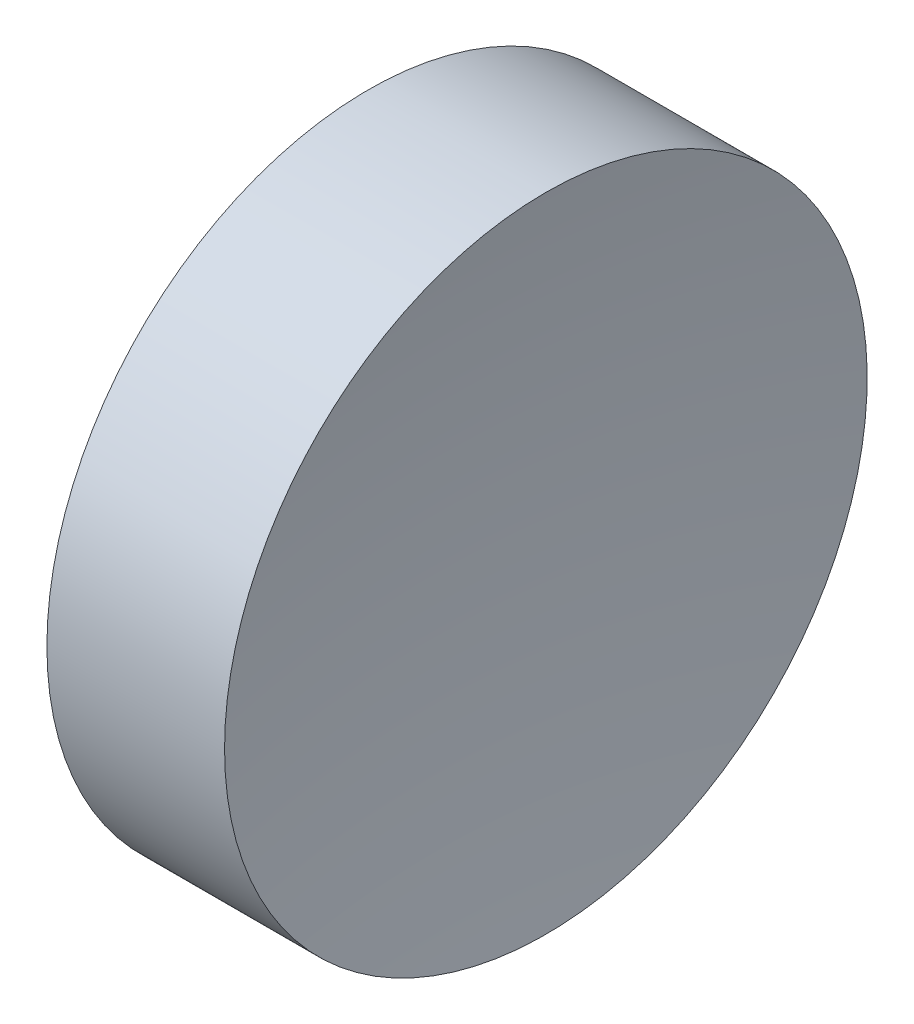
ISO-10303-21;
HEADER;
FILE_DESCRIPTION(('STEP AP214'),'2;1');
FILE_NAME('part.step','',(''),(''),'','','');
FILE_SCHEMA(('AUTOMOTIVE_DESIGN { 1 0 10303 214 1 1 1 1 }'));
ENDSEC;
DATA;
#1=APPLICATION_CONTEXT('core data for automotive mechanical design processes');
#2=APPLICATION_PROTOCOL_DEFINITION('international standard','automotive_design',2000,#1);
#3=PRODUCT_CONTEXT('',#1,'mechanical');
#4=PRODUCT('Part','Part','',(#3));
#5=PRODUCT_RELATED_PRODUCT_CATEGORY('part','',(#4));
#6=PRODUCT_DEFINITION_FORMATION('','',#4);
#7=PRODUCT_DEFINITION_CONTEXT('part definition',#1,'design');
#8=PRODUCT_DEFINITION('design','',#6,#7);
#9=PRODUCT_DEFINITION_SHAPE('','',#8);
#10=(LENGTH_UNIT() NAMED_UNIT(*) SI_UNIT(.MILLI.,.METRE.));
#11=(NAMED_UNIT(*) PLANE_ANGLE_UNIT() SI_UNIT($,.RADIAN.));
#12=(NAMED_UNIT(*) SI_UNIT($,.STERADIAN.) SOLID_ANGLE_UNIT());
#13=UNCERTAINTY_MEASURE_WITH_UNIT(LENGTH_MEASURE(1.E-05),#10,'distance_accuracy_value','');
#14=(GEOMETRIC_REPRESENTATION_CONTEXT(3) GLOBAL_UNCERTAINTY_ASSIGNED_CONTEXT((#13)) GLOBAL_UNIT_ASSIGNED_CONTEXT((#10,
#11,#12)) REPRESENTATION_CONTEXT('',''));
#15=CARTESIAN_POINT('',(0.,0.,0.));
#16=DIRECTION('',(0.,0.,1.));
#17=DIRECTION('',(1.,0.,0.));
#18=AXIS2_PLACEMENT_3D('',#15,#16,#17);
#19=CARTESIAN_POINT('',(44.4592688325745,13.031126091403,0.));
#20=DIRECTION('',(-1.,0.,0.));
#21=DIRECTION('',(0.,1.,0.));
#22=AXIS2_PLACEMENT_3D('',#19,#20,#21);
#23=SPHERICAL_SURFACE('',#22,20.65);
#24=CARTESIAN_POINT('',(24.0509372006159,13.031126091403,0.));
#25=DIRECTION('',(-1.,0.,0.));
#26=DIRECTION('',(0.,0.,1.));
#27=AXIS2_PLACEMENT_3D('',#24,#25,#26);
#28=CIRCLE('',#27,3.15);
#29=CARTESIAN_POINT('',(24.0509372006159,13.031126091403,3.15));
#30=VERTEX_POINT('',#29);
#31=EDGE_CURVE('E10',#30,#30,#28,.T.);
#32=ORIENTED_EDGE('',*,*,#31,.F.);
#33=EDGE_LOOP('',(#32));
#34=FACE_BOUND('',#33,.T.);
#35=ADVANCED_FACE('F35',(#34),#23,.F.);
#36=CARTESIAN_POINT('',(20.6840306351329,13.031126091403,0.));
#37=DIRECTION('',(-1.,0.,0.));
#38=DIRECTION('',(0.,0.,1.));
#39=AXIS2_PLACEMENT_3D('',#36,#37,#38);
#40=CYLINDRICAL_SURFACE('',#39,3.15);
#41=CARTESIAN_POINT('',(22.3092688325745,13.031126091403,0.));
#42=DIRECTION('',(-1.,0.,0.));
#43=DIRECTION('',(0.,0.,1.));
#44=AXIS2_PLACEMENT_3D('',#41,#42,#43);
#45=CIRCLE('',#44,3.15);
#46=CARTESIAN_POINT('',(22.3092688325745,13.031126091403,3.15));
#47=VERTEX_POINT('',#46);
#48=EDGE_CURVE('E41',#47,#47,#45,.T.);
#49=ORIENTED_EDGE('',*,*,#48,.F.);
#50=EDGE_LOOP('',(#49));
#51=FACE_BOUND('',#50,.T.);
#52=ORIENTED_EDGE('',*,*,#31,.T.);
#53=EDGE_LOOP('',(#52));
#54=FACE_BOUND('',#53,.T.);
#55=ADVANCED_FACE('F49',(#51,#54),#40,.T.);
#56=CARTESIAN_POINT('',(22.3092688325745,13.031126091403,0.));
#57=DIRECTION('',(1.,0.,0.));
#58=DIRECTION('',(0.,0.,-1.));
#59=AXIS2_PLACEMENT_3D('',#56,#57,#58);
#60=PLANE('',#59);
#61=ORIENTED_EDGE('',*,*,#48,.T.);
#62=EDGE_LOOP('',(#61));
#63=FACE_BOUND('',#62,.T.);
#64=ADVANCED_FACE('F47',(#63),#60,.F.);
#65=CLOSED_SHELL('',(#35,#55,#64));
#66=MANIFOLD_SOLID_BREP('B2',#65);
#67=ADVANCED_BREP_SHAPE_REPRESENTATION('',(#18,#66),#14);
#68=SHAPE_DEFINITION_REPRESENTATION(#9,#67);
ENDSEC;
END-ISO-10303-21;
